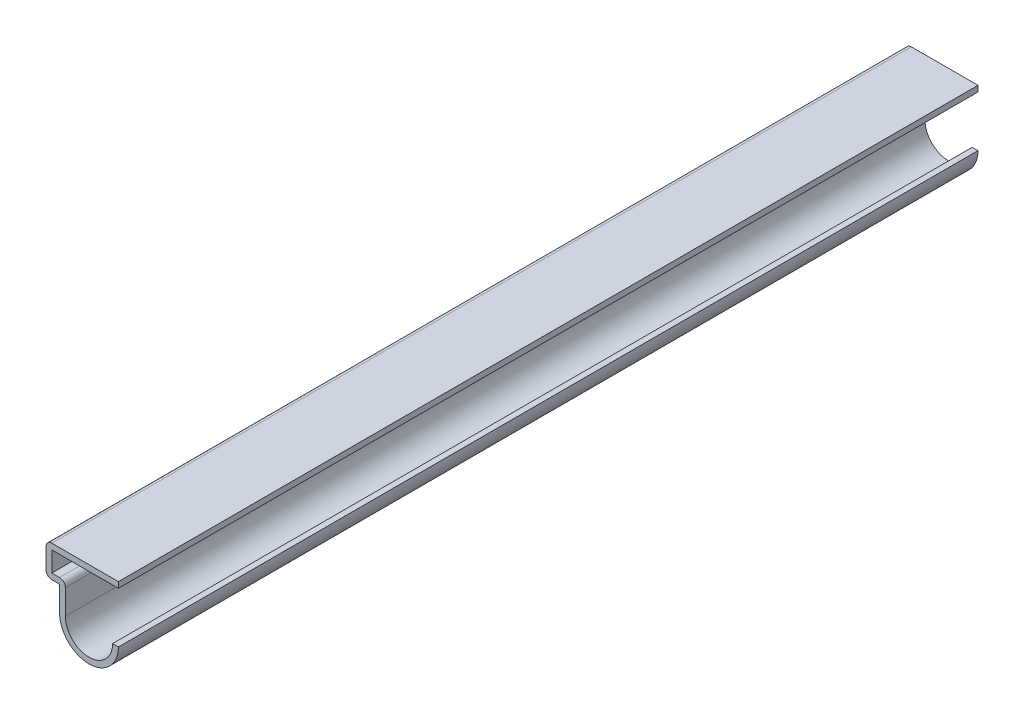
ISO-10303-21;
HEADER;
FILE_DESCRIPTION(('STEP AP214'),'2;1');
FILE_NAME('part.step','',(''),(''),'','','');
FILE_SCHEMA(('AUTOMOTIVE_DESIGN { 1 0 10303 214 1 1 1 1 }'));
ENDSEC;
DATA;
#1=APPLICATION_CONTEXT('core data for automotive mechanical design processes');
#2=APPLICATION_PROTOCOL_DEFINITION('international standard','automotive_design',2000,#1);
#3=PRODUCT_CONTEXT('',#1,'mechanical');
#4=PRODUCT('Part','Part','',(#3));
#5=PRODUCT_RELATED_PRODUCT_CATEGORY('part','',(#4));
#6=PRODUCT_DEFINITION_FORMATION('','',#4);
#7=PRODUCT_DEFINITION_CONTEXT('part definition',#1,'design');
#8=PRODUCT_DEFINITION('design','',#6,#7);
#9=PRODUCT_DEFINITION_SHAPE('','',#8);
#10=(LENGTH_UNIT() NAMED_UNIT(*) SI_UNIT(.MILLI.,.METRE.));
#11=(NAMED_UNIT(*) PLANE_ANGLE_UNIT() SI_UNIT($,.RADIAN.));
#12=(NAMED_UNIT(*) SI_UNIT($,.STERADIAN.) SOLID_ANGLE_UNIT());
#13=UNCERTAINTY_MEASURE_WITH_UNIT(LENGTH_MEASURE(1.E-05),#10,'distance_accuracy_value','');
#14=(GEOMETRIC_REPRESENTATION_CONTEXT(3) GLOBAL_UNCERTAINTY_ASSIGNED_CONTEXT((#13)) GLOBAL_UNIT_ASSIGNED_CONTEXT((#10,
#11,#12)) REPRESENTATION_CONTEXT('',''));
#15=CARTESIAN_POINT('',(0.,0.,0.));
#16=DIRECTION('',(0.,0.,1.));
#17=DIRECTION('',(1.,0.,0.));
#18=AXIS2_PLACEMENT_3D('',#15,#16,#17);
#19=CARTESIAN_POINT('',(-12.7,8.905875,-150.8125));
#20=DIRECTION('',(0.,-1.,0.));
#21=DIRECTION('',(0.,0.,-1.));
#22=AXIS2_PLACEMENT_3D('',#19,#20,#21);
#23=PLANE('',#22);
#24=DIRECTION('',(1.,0.,0.));
#25=VECTOR('',#24,1.);
#26=CARTESIAN_POINT('',(-12.7,8.905875,0.));
#27=LINE('',#26,#25);
#28=CARTESIAN_POINT('',(-11.684,8.905875,0.));
#29=VERTEX_POINT('',#28);
#30=CARTESIAN_POINT('',(0.,8.905875,0.));
#31=VERTEX_POINT('',#30);
#32=EDGE_CURVE('E195',#29,#31,#27,.T.);
#33=ORIENTED_EDGE('',*,*,#32,.F.);
#34=DIRECTION('',(0.,0.,1.));
#35=VECTOR('',#34,1.);
#36=CARTESIAN_POINT('',(-11.684,8.905875,-150.8125));
#37=LINE('',#36,#35);
#38=CARTESIAN_POINT('',(-11.684,8.905875,-150.8125));
#39=VERTEX_POINT('',#38);
#40=EDGE_CURVE('E167',#39,#29,#37,.T.);
#41=ORIENTED_EDGE('',*,*,#40,.F.);
#42=DIRECTION('',(1.,0.,0.));
#43=VECTOR('',#42,1.);
#44=CARTESIAN_POINT('',(-12.7,8.905875,-150.8125));
#45=LINE('',#44,#43);
#46=CARTESIAN_POINT('',(0.,8.905875,-150.8125));
#47=VERTEX_POINT('',#46);
#48=EDGE_CURVE('E149',#39,#47,#45,.T.);
#49=ORIENTED_EDGE('',*,*,#48,.T.);
#50=DIRECTION('',(0.,0.,1.));
#51=VECTOR('',#50,1.);
#52=CARTESIAN_POINT('',(0.,8.905875,-150.8125));
#53=LINE('',#52,#51);
#54=EDGE_CURVE('E157',#47,#31,#53,.T.);
#55=ORIENTED_EDGE('',*,*,#54,.T.);
#56=EDGE_LOOP('',(#33,#41,#49,#55));
#57=FACE_BOUND('',#56,.T.);
#58=ADVANCED_FACE('F35',(#57),#23,.T.);
#59=CARTESIAN_POINT('',(-11.684,4.365625,-150.8125));
#60=DIRECTION('',(1.,0.,0.));
#61=DIRECTION('',(0.,0.,-1.));
#62=AXIS2_PLACEMENT_3D('',#59,#60,#61);
#63=PLANE('',#62);
#64=DIRECTION('',(0.,1.,0.));
#65=VECTOR('',#64,1.);
#66=CARTESIAN_POINT('',(-11.684,4.365625,0.));
#67=LINE('',#66,#65);
#68=CARTESIAN_POINT('',(-11.684,5.381625,0.));
#69=VERTEX_POINT('',#68);
#70=EDGE_CURVE('E168',#69,#29,#67,.T.);
#71=ORIENTED_EDGE('',*,*,#70,.F.);
#72=DIRECTION('',(0.,0.,1.));
#73=VECTOR('',#72,1.);
#74=CARTESIAN_POINT('',(-11.684,5.381625,-150.8125));
#75=LINE('',#74,#73);
#76=CARTESIAN_POINT('',(-11.684,5.381625,-150.8125));
#77=VERTEX_POINT('',#76);
#78=EDGE_CURVE('E220',#77,#69,#75,.T.);
#79=ORIENTED_EDGE('',*,*,#78,.F.);
#80=DIRECTION('',(0.,1.,0.));
#81=VECTOR('',#80,1.);
#82=CARTESIAN_POINT('',(-11.684,4.365625,-150.8125));
#83=LINE('',#82,#81);
#84=EDGE_CURVE('E165',#77,#39,#83,.T.);
#85=ORIENTED_EDGE('',*,*,#84,.T.);
#86=ORIENTED_EDGE('',*,*,#40,.T.);
#87=EDGE_LOOP('',(#71,#79,#85,#86));
#88=FACE_BOUND('',#87,.T.);
#89=ADVANCED_FACE('F279',(#88),#63,.T.);
#90=CARTESIAN_POINT('',(-10.31875,5.381625,-150.8125));
#91=DIRECTION('',(0.,1.,0.));
#92=DIRECTION('',(-1.,0.,0.));
#93=AXIS2_PLACEMENT_3D('',#90,#91,#92);
#94=PLANE('',#93);
#95=DIRECTION('',(-1.,0.,0.));
#96=VECTOR('',#95,1.);
#97=CARTESIAN_POINT('',(-10.31875,5.381625,0.));
#98=LINE('',#97,#96);
#99=CARTESIAN_POINT('',(-10.31875,5.381625,0.));
#100=VERTEX_POINT('',#99);
#101=EDGE_CURVE('E171',#100,#69,#98,.T.);
#102=ORIENTED_EDGE('',*,*,#101,.F.);
#103=DIRECTION('',(0.,0.,1.));
#104=VECTOR('',#103,1.);
#105=CARTESIAN_POINT('',(-10.31875,5.381625,-150.8125));
#106=LINE('',#105,#104);
#107=CARTESIAN_POINT('',(-10.31875,5.381625,-150.8125));
#108=VERTEX_POINT('',#107);
#109=EDGE_CURVE('E245',#100,#108,#106,.F.);
#110=ORIENTED_EDGE('',*,*,#109,.T.);
#111=DIRECTION('',(-1.,0.,0.));
#112=VECTOR('',#111,1.);
#113=CARTESIAN_POINT('',(-10.31875,5.381625,-150.8125));
#114=LINE('',#113,#112);
#115=EDGE_CURVE('E192',#108,#77,#114,.T.);
#116=ORIENTED_EDGE('',*,*,#115,.T.);
#117=ORIENTED_EDGE('',*,*,#78,.T.);
#118=EDGE_LOOP('',(#102,#110,#116,#117));
#119=FACE_BOUND('',#118,.T.);
#120=ADVANCED_FACE('F320',(#119),#94,.T.);
#121=CARTESIAN_POINT('',(-9.30275,0.,-150.8125));
#122=DIRECTION('',(1.,0.,0.));
#123=DIRECTION('',(0.,0.,-1.));
#124=AXIS2_PLACEMENT_3D('',#121,#122,#123);
#125=PLANE('',#124);
#126=DIRECTION('',(0.,1.,0.));
#127=VECTOR('',#126,1.);
#128=CARTESIAN_POINT('',(-9.30275,0.,-150.8125));
#129=LINE('',#128,#127);
#130=CARTESIAN_POINT('',(-9.30275,0.,-150.8125));
#131=VERTEX_POINT('',#130);
#132=CARTESIAN_POINT('',(-9.30275,4.365625,-150.8125));
#133=VERTEX_POINT('',#132);
#134=EDGE_CURVE('E189',#131,#133,#129,.T.);
#135=ORIENTED_EDGE('',*,*,#134,.T.);
#136=DIRECTION('',(0.,0.,1.));
#137=VECTOR('',#136,1.);
#138=CARTESIAN_POINT('',(-9.30275,4.365625,-150.8125));
#139=LINE('',#138,#137);
#140=CARTESIAN_POINT('',(-9.30275,4.365625,0.));
#141=VERTEX_POINT('',#140);
#142=EDGE_CURVE('E219',#133,#141,#139,.T.);
#143=ORIENTED_EDGE('',*,*,#142,.T.);
#144=DIRECTION('',(0.,1.,0.));
#145=VECTOR('',#144,1.);
#146=CARTESIAN_POINT('',(-9.30275,0.,0.));
#147=LINE('',#146,#145);
#148=CARTESIAN_POINT('',(-9.30275,0.,0.));
#149=VERTEX_POINT('',#148);
#150=EDGE_CURVE('E214',#149,#141,#147,.T.);
#151=ORIENTED_EDGE('',*,*,#150,.F.);
#152=DIRECTION('',(0.,0.,1.));
#153=VECTOR('',#152,1.);
#154=CARTESIAN_POINT('',(-9.30275,0.,-150.8125));
#155=LINE('',#154,#153);
#156=EDGE_CURVE('E223',#131,#149,#155,.T.);
#157=ORIENTED_EDGE('',*,*,#156,.F.);
#158=EDGE_LOOP('',(#135,#143,#151,#157));
#159=FACE_BOUND('',#158,.T.);
#160=ADVANCED_FACE('F289',(#159),#125,.T.);
#161=CARTESIAN_POINT('',(-5.159375,0.,-150.8125));
#162=DIRECTION('',(0.,0.,1.));
#163=DIRECTION('',(1.,0.,0.));
#164=AXIS2_PLACEMENT_3D('',#161,#162,#163);
#165=CYLINDRICAL_SURFACE('',#164,4.143375);
#166=CARTESIAN_POINT('',(-5.159375,0.,0.));
#167=DIRECTION('',(0.,0.,1.));
#168=DIRECTION('',(1.,0.,0.));
#169=AXIS2_PLACEMENT_3D('',#166,#167,#168);
#170=CIRCLE('',#169,4.143375);
#171=CARTESIAN_POINT('',(-1.016,0.,0.));
#172=VERTEX_POINT('',#171);
#173=EDGE_CURVE('E211',#172,#149,#170,.F.);
#174=ORIENTED_EDGE('',*,*,#173,.F.);
#175=DIRECTION('',(0.,0.,1.));
#176=VECTOR('',#175,1.);
#177=CARTESIAN_POINT('',(-1.016,0.,-150.8125));
#178=LINE('',#177,#176);
#179=CARTESIAN_POINT('',(-1.016,0.,-150.8125));
#180=VERTEX_POINT('',#179);
#181=EDGE_CURVE('E225',#180,#172,#178,.T.);
#182=ORIENTED_EDGE('',*,*,#181,.F.);
#183=CARTESIAN_POINT('',(-5.159375,0.,-150.8125));
#184=DIRECTION('',(0.,0.,1.));
#185=DIRECTION('',(1.,0.,0.));
#186=AXIS2_PLACEMENT_3D('',#183,#184,#185);
#187=CIRCLE('',#186,4.143375);
#188=EDGE_CURVE('E186',#180,#131,#187,.F.);
#189=ORIENTED_EDGE('',*,*,#188,.T.);
#190=ORIENTED_EDGE('',*,*,#156,.T.);
#191=EDGE_LOOP('',(#174,#182,#189,#190));
#192=FACE_BOUND('',#191,.T.);
#193=ADVANCED_FACE('F294',(#192),#165,.F.);
#194=CARTESIAN_POINT('',(-1.016,0.,-150.8125));
#195=DIRECTION('',(0.,-1.,0.));
#196=DIRECTION('',(1.,0.,0.));
#197=AXIS2_PLACEMENT_3D('',#194,#195,#196);
#198=PLANE('',#197);
#199=DIRECTION('',(1.,0.,0.));
#200=VECTOR('',#199,1.);
#201=CARTESIAN_POINT('',(-1.016,0.,0.));
#202=LINE('',#201,#200);
#203=CARTESIAN_POINT('',(0.,0.,0.));
#204=VERTEX_POINT('',#203);
#205=EDGE_CURVE('E209',#172,#204,#202,.T.);
#206=ORIENTED_EDGE('',*,*,#205,.T.);
#207=DIRECTION('',(0.,0.,1.));
#208=VECTOR('',#207,1.);
#209=CARTESIAN_POINT('',(0.,0.,-150.8125));
#210=LINE('',#209,#208);
#211=CARTESIAN_POINT('',(0.,0.,-150.8125));
#212=VERTEX_POINT('',#211);
#213=EDGE_CURVE('E227',#212,#204,#210,.T.);
#214=ORIENTED_EDGE('',*,*,#213,.F.);
#215=DIRECTION('',(1.,0.,0.));
#216=VECTOR('',#215,1.);
#217=CARTESIAN_POINT('',(-1.016,0.,-150.8125));
#218=LINE('',#217,#216);
#219=EDGE_CURVE('E184',#180,#212,#218,.T.);
#220=ORIENTED_EDGE('',*,*,#219,.F.);
#221=ORIENTED_EDGE('',*,*,#181,.T.);
#222=EDGE_LOOP('',(#206,#214,#220,#221));
#223=FACE_BOUND('',#222,.T.);
#224=ADVANCED_FACE('F301',(#223),#198,.F.);
#225=CARTESIAN_POINT('',(-5.159375,0.,-150.8125));
#226=DIRECTION('',(0.,0.,1.));
#227=DIRECTION('',(1.,0.,0.));
#228=AXIS2_PLACEMENT_3D('',#225,#226,#227);
#229=CYLINDRICAL_SURFACE('',#228,5.159375);
#230=CARTESIAN_POINT('',(-5.159375,0.,0.));
#231=DIRECTION('',(0.,0.,-1.));
#232=DIRECTION('',(-1.,0.,0.));
#233=AXIS2_PLACEMENT_3D('',#230,#231,#232);
#234=CIRCLE('',#233,5.159375);
#235=CARTESIAN_POINT('',(-10.31875,0.,0.));
#236=VERTEX_POINT('',#235);
#237=EDGE_CURVE('E207',#204,#236,#234,.T.);
#238=ORIENTED_EDGE('',*,*,#237,.T.);
#239=DIRECTION('',(0.,0.,1.));
#240=VECTOR('',#239,1.);
#241=CARTESIAN_POINT('',(-10.31875,0.,-150.8125));
#242=LINE('',#241,#240);
#243=CARTESIAN_POINT('',(-10.31875,0.,-150.8125));
#244=VERTEX_POINT('',#243);
#245=EDGE_CURVE('E230',#244,#236,#242,.T.);
#246=ORIENTED_EDGE('',*,*,#245,.F.);
#247=CARTESIAN_POINT('',(-5.159375,0.,-150.8125));
#248=DIRECTION('',(0.,0.,-1.));
#249=DIRECTION('',(-1.,0.,0.));
#250=AXIS2_PLACEMENT_3D('',#247,#248,#249);
#251=CIRCLE('',#250,5.159375);
#252=EDGE_CURVE('E182',#212,#244,#251,.T.);
#253=ORIENTED_EDGE('',*,*,#252,.F.);
#254=ORIENTED_EDGE('',*,*,#213,.T.);
#255=EDGE_LOOP('',(#238,#246,#253,#254));
#256=FACE_BOUND('',#255,.T.);
#257=ADVANCED_FACE('F303',(#256),#229,.T.);
#258=CARTESIAN_POINT('',(-10.31875,0.,-150.8125));
#259=DIRECTION('',(1.,0.,0.));
#260=DIRECTION('',(0.,0.,-1.));
#261=AXIS2_PLACEMENT_3D('',#258,#259,#260);
#262=PLANE('',#261);
#263=DIRECTION('',(0.,1.,0.));
#264=VECTOR('',#263,1.);
#265=CARTESIAN_POINT('',(-10.31875,0.,0.));
#266=LINE('',#265,#264);
#267=CARTESIAN_POINT('',(-10.31875,4.365625,0.));
#268=VERTEX_POINT('',#267);
#269=EDGE_CURVE('E205',#236,#268,#266,.T.);
#270=ORIENTED_EDGE('',*,*,#269,.T.);
#271=DIRECTION('',(0.,0.,1.));
#272=VECTOR('',#271,1.);
#273=CARTESIAN_POINT('',(-10.31875,4.365625,-150.8125));
#274=LINE('',#273,#272);
#275=CARTESIAN_POINT('',(-10.31875,4.365625,-150.8125));
#276=VERTEX_POINT('',#275);
#277=EDGE_CURVE('E233',#276,#268,#274,.T.);
#278=ORIENTED_EDGE('',*,*,#277,.F.);
#279=DIRECTION('',(0.,1.,0.));
#280=VECTOR('',#279,1.);
#281=CARTESIAN_POINT('',(-10.31875,0.,-150.8125));
#282=LINE('',#281,#280);
#283=EDGE_CURVE('E180',#244,#276,#282,.T.);
#284=ORIENTED_EDGE('',*,*,#283,.F.);
#285=ORIENTED_EDGE('',*,*,#245,.T.);
#286=EDGE_LOOP('',(#270,#278,#284,#285));
#287=FACE_BOUND('',#286,.T.);
#288=ADVANCED_FACE('F306',(#287),#262,.F.);
#289=CARTESIAN_POINT('',(-10.31875,4.365625,-150.8125));
#290=DIRECTION('',(0.,1.,0.));
#291=DIRECTION('',(-1.,0.,0.));
#292=AXIS2_PLACEMENT_3D('',#289,#290,#291);
#293=PLANE('',#292);
#294=DIRECTION('',(-1.,0.,0.));
#295=VECTOR('',#294,1.);
#296=CARTESIAN_POINT('',(-10.31875,4.365625,0.));
#297=LINE('',#296,#295);
#298=CARTESIAN_POINT('',(-11.684,4.365625,0.));
#299=VERTEX_POINT('',#298);
#300=EDGE_CURVE('E202',#268,#299,#297,.T.);
#301=ORIENTED_EDGE('',*,*,#300,.T.);
#302=DIRECTION('',(0.,0.,1.));
#303=VECTOR('',#302,1.);
#304=CARTESIAN_POINT('',(-11.684,4.365625,-150.8125));
#305=LINE('',#304,#303);
#306=CARTESIAN_POINT('',(-11.684,4.365625,-150.8125));
#307=VERTEX_POINT('',#306);
#308=EDGE_CURVE('E43',#299,#307,#305,.F.);
#309=ORIENTED_EDGE('',*,*,#308,.T.);
#310=DIRECTION('',(-1.,0.,0.));
#311=VECTOR('',#310,1.);
#312=CARTESIAN_POINT('',(-10.31875,4.365625,-150.8125));
#313=LINE('',#312,#311);
#314=EDGE_CURVE('E177',#276,#307,#313,.T.);
#315=ORIENTED_EDGE('',*,*,#314,.F.);
#316=ORIENTED_EDGE('',*,*,#277,.T.);
#317=EDGE_LOOP('',(#301,#309,#315,#316));
#318=FACE_BOUND('',#317,.T.);
#319=ADVANCED_FACE('F258',(#318),#293,.F.);
#320=CARTESIAN_POINT('',(-12.7,4.365625,-150.8125));
#321=DIRECTION('',(1.,0.,0.));
#322=DIRECTION('',(0.,0.,-1.));
#323=AXIS2_PLACEMENT_3D('',#320,#321,#322);
#324=PLANE('',#323);
#325=DIRECTION('',(0.,1.,0.));
#326=VECTOR('',#325,1.);
#327=CARTESIAN_POINT('',(-12.7,4.365625,-150.8125));
#328=LINE('',#327,#326);
#329=CARTESIAN_POINT('',(-12.7,5.381625,-150.8125));
#330=VERTEX_POINT('',#329);
#331=CARTESIAN_POINT('',(-12.7,8.905875,-150.8125));
#332=VERTEX_POINT('',#331);
#333=EDGE_CURVE('E175',#330,#332,#328,.T.);
#334=ORIENTED_EDGE('',*,*,#333,.F.);
#335=DIRECTION('',(0.,0.,1.));
#336=VECTOR('',#335,1.);
#337=CARTESIAN_POINT('',(-12.7,5.381625,-150.8125));
#338=LINE('',#337,#336);
#339=CARTESIAN_POINT('',(-12.7,5.381625,0.));
#340=VERTEX_POINT('',#339);
#341=EDGE_CURVE('E253',#330,#340,#338,.T.);
#342=ORIENTED_EDGE('',*,*,#341,.T.);
#343=DIRECTION('',(0.,1.,0.));
#344=VECTOR('',#343,1.);
#345=CARTESIAN_POINT('',(-12.7,4.365625,0.));
#346=LINE('',#345,#344);
#347=CARTESIAN_POINT('',(-12.7,8.905875,0.));
#348=VERTEX_POINT('',#347);
#349=EDGE_CURVE('E200',#340,#348,#346,.T.);
#350=ORIENTED_EDGE('',*,*,#349,.T.);
#351=DIRECTION('',(0.,0.,1.));
#352=VECTOR('',#351,1.);
#353=CARTESIAN_POINT('',(-12.7,8.905875,-150.8125));
#354=LINE('',#353,#352);
#355=EDGE_CURVE('E58',#348,#332,#354,.F.);
#356=ORIENTED_EDGE('',*,*,#355,.T.);
#357=EDGE_LOOP('',(#334,#342,#350,#356));
#358=FACE_BOUND('',#357,.T.);
#359=ADVANCED_FACE('F267',(#358),#324,.F.);
#360=CARTESIAN_POINT('',(-12.7,9.921875,-150.8125));
#361=DIRECTION('',(0.,-1.,0.));
#362=DIRECTION('',(0.,0.,-1.));
#363=AXIS2_PLACEMENT_3D('',#360,#361,#362);
#364=PLANE('',#363);
#365=DIRECTION('',(1.,0.,0.));
#366=VECTOR('',#365,1.);
#367=CARTESIAN_POINT('',(-12.7,9.921875,-150.8125));
#368=LINE('',#367,#366);
#369=CARTESIAN_POINT('',(-11.684,9.921875,-150.8125));
#370=VERTEX_POINT('',#369);
#371=CARTESIAN_POINT('',(0.,9.921875,-150.8125));
#372=VERTEX_POINT('',#371);
#373=EDGE_CURVE('E151',#370,#372,#368,.T.);
#374=ORIENTED_EDGE('',*,*,#373,.F.);
#375=DIRECTION('',(0.,0.,1.));
#376=VECTOR('',#375,1.);
#377=CARTESIAN_POINT('',(-11.684,9.921875,-150.8125));
#378=LINE('',#377,#376);
#379=CARTESIAN_POINT('',(-11.684,9.921875,0.));
#380=VERTEX_POINT('',#379);
#381=EDGE_CURVE('E11',#370,#380,#378,.T.);
#382=ORIENTED_EDGE('',*,*,#381,.T.);
#383=DIRECTION('',(1.,0.,0.));
#384=VECTOR('',#383,1.);
#385=CARTESIAN_POINT('',(-12.7,9.921875,0.));
#386=LINE('',#385,#384);
#387=CARTESIAN_POINT('',(0.,9.921875,0.));
#388=VERTEX_POINT('',#387);
#389=EDGE_CURVE('E198',#380,#388,#386,.T.);
#390=ORIENTED_EDGE('',*,*,#389,.T.);
#391=DIRECTION('',(0.,0.,1.));
#392=VECTOR('',#391,1.);
#393=CARTESIAN_POINT('',(0.,9.921875,-150.8125));
#394=LINE('',#393,#392);
#395=EDGE_CURVE('E164',#372,#388,#394,.T.);
#396=ORIENTED_EDGE('',*,*,#395,.F.);
#397=EDGE_LOOP('',(#374,#382,#390,#396));
#398=FACE_BOUND('',#397,.T.);
#399=ADVANCED_FACE('F274',(#398),#364,.F.);
#400=CARTESIAN_POINT('',(0.,9.921875,-150.8125));
#401=DIRECTION('',(-1.,0.,0.));
#402=DIRECTION('',(0.,0.,1.));
#403=AXIS2_PLACEMENT_3D('',#400,#401,#402);
#404=PLANE('',#403);
#405=DIRECTION('',(0.,-1.,0.));
#406=VECTOR('',#405,1.);
#407=CARTESIAN_POINT('',(0.,9.921875,0.));
#408=LINE('',#407,#406);
#409=EDGE_CURVE('E160',#388,#31,#408,.T.);
#410=ORIENTED_EDGE('',*,*,#409,.T.);
#411=ORIENTED_EDGE('',*,*,#54,.F.);
#412=DIRECTION('',(0.,-1.,0.));
#413=VECTOR('',#412,1.);
#414=CARTESIAN_POINT('',(0.,9.921875,-150.8125));
#415=LINE('',#414,#413);
#416=EDGE_CURVE('E143',#372,#47,#415,.T.);
#417=ORIENTED_EDGE('',*,*,#416,.F.);
#418=ORIENTED_EDGE('',*,*,#395,.T.);
#419=EDGE_LOOP('',(#410,#411,#417,#418));
#420=FACE_BOUND('',#419,.T.);
#421=ADVANCED_FACE('F158',(#420),#404,.F.);
#422=CARTESIAN_POINT('',(-5.159375,0.,-150.8125));
#423=DIRECTION('',(0.,0.,-1.));
#424=DIRECTION('',(-1.,0.,0.));
#425=AXIS2_PLACEMENT_3D('',#422,#423,#424);
#426=PLANE('',#425);
#427=ORIENTED_EDGE('',*,*,#115,.F.);
#428=CARTESIAN_POINT('',(-10.31875,4.365625,-150.8125));
#429=DIRECTION('',(0.,0.,-1.));
#430=DIRECTION('',(-1.,0.,0.));
#431=AXIS2_PLACEMENT_3D('',#428,#429,#430);
#432=CIRCLE('',#431,1.016);
#433=EDGE_CURVE('E250',#108,#133,#432,.T.);
#434=ORIENTED_EDGE('',*,*,#433,.T.);
#435=ORIENTED_EDGE('',*,*,#134,.F.);
#436=ORIENTED_EDGE('',*,*,#188,.F.);
#437=ORIENTED_EDGE('',*,*,#219,.T.);
#438=ORIENTED_EDGE('',*,*,#252,.T.);
#439=ORIENTED_EDGE('',*,*,#283,.T.);
#440=ORIENTED_EDGE('',*,*,#314,.T.);
#441=CARTESIAN_POINT('',(-11.684,5.381625,-150.8125));
#442=DIRECTION('',(0.,0.,-1.));
#443=DIRECTION('',(-1.,0.,0.));
#444=AXIS2_PLACEMENT_3D('',#441,#442,#443);
#445=CIRCLE('',#444,1.016);
#446=EDGE_CURVE('E248',#307,#330,#445,.T.);
#447=ORIENTED_EDGE('',*,*,#446,.T.);
#448=ORIENTED_EDGE('',*,*,#333,.T.);
#449=CARTESIAN_POINT('',(-11.684,8.905875,-150.8125));
#450=DIRECTION('',(0.,0.,-1.));
#451=DIRECTION('',(-1.,0.,0.));
#452=AXIS2_PLACEMENT_3D('',#449,#450,#451);
#453=CIRCLE('',#452,1.016);
#454=EDGE_CURVE('E50',#332,#370,#453,.T.);
#455=ORIENTED_EDGE('',*,*,#454,.T.);
#456=ORIENTED_EDGE('',*,*,#373,.T.);
#457=ORIENTED_EDGE('',*,*,#416,.T.);
#458=ORIENTED_EDGE('',*,*,#48,.F.);
#459=ORIENTED_EDGE('',*,*,#84,.F.);
#460=EDGE_LOOP('',(#427,#434,#435,#436,#437,#438,#439,#440,#447,#448,#455,#456,#457,#458,#459));
#461=FACE_BOUND('',#460,.T.);
#462=ADVANCED_FACE('F146',(#461),#426,.T.);
#463=CARTESIAN_POINT('',(-5.159375,0.,0.));
#464=DIRECTION('',(0.,0.,-1.));
#465=DIRECTION('',(-1.,0.,0.));
#466=AXIS2_PLACEMENT_3D('',#463,#464,#465);
#467=PLANE('',#466);
#468=ORIENTED_EDGE('',*,*,#150,.T.);
#469=CARTESIAN_POINT('',(-10.31875,4.365625,0.));
#470=DIRECTION('',(0.,0.,-1.));
#471=DIRECTION('',(-1.,0.,0.));
#472=AXIS2_PLACEMENT_3D('',#469,#470,#471);
#473=CIRCLE('',#472,1.016);
#474=EDGE_CURVE('E243',#141,#100,#473,.F.);
#475=ORIENTED_EDGE('',*,*,#474,.T.);
#476=ORIENTED_EDGE('',*,*,#101,.T.);
#477=ORIENTED_EDGE('',*,*,#70,.T.);
#478=ORIENTED_EDGE('',*,*,#32,.T.);
#479=ORIENTED_EDGE('',*,*,#409,.F.);
#480=ORIENTED_EDGE('',*,*,#389,.F.);
#481=CARTESIAN_POINT('',(-11.684,8.905875,0.));
#482=DIRECTION('',(0.,0.,-1.));
#483=DIRECTION('',(-1.,0.,0.));
#484=AXIS2_PLACEMENT_3D('',#481,#482,#483);
#485=CIRCLE('',#484,1.016);
#486=EDGE_CURVE('E239',#380,#348,#485,.F.);
#487=ORIENTED_EDGE('',*,*,#486,.T.);
#488=ORIENTED_EDGE('',*,*,#349,.F.);
#489=CARTESIAN_POINT('',(-11.684,5.381625,0.));
#490=DIRECTION('',(0.,0.,-1.));
#491=DIRECTION('',(-1.,0.,0.));
#492=AXIS2_PLACEMENT_3D('',#489,#490,#491);
#493=CIRCLE('',#492,1.016);
#494=EDGE_CURVE('E241',#340,#299,#493,.F.);
#495=ORIENTED_EDGE('',*,*,#494,.T.);
#496=ORIENTED_EDGE('',*,*,#300,.F.);
#497=ORIENTED_EDGE('',*,*,#269,.F.);
#498=ORIENTED_EDGE('',*,*,#237,.F.);
#499=ORIENTED_EDGE('',*,*,#205,.F.);
#500=ORIENTED_EDGE('',*,*,#173,.T.);
#501=EDGE_LOOP('',(#468,#475,#476,#477,#478,#479,#480,#487,#488,#495,#496,#497,#498,#499,#500));
#502=FACE_BOUND('',#501,.T.);
#503=ADVANCED_FACE('F269',(#502),#467,.F.);
#504=CARTESIAN_POINT('',(-10.31875,4.365625,-150.8125));
#505=DIRECTION('',(0.,0.,1.));
#506=DIRECTION('',(1.,0.,0.));
#507=AXIS2_PLACEMENT_3D('',#504,#505,#506);
#508=CYLINDRICAL_SURFACE('',#507,1.016);
#509=ORIENTED_EDGE('',*,*,#433,.F.);
#510=ORIENTED_EDGE('',*,*,#109,.F.);
#511=ORIENTED_EDGE('',*,*,#474,.F.);
#512=ORIENTED_EDGE('',*,*,#142,.F.);
#513=EDGE_LOOP('',(#509,#510,#511,#512));
#514=FACE_BOUND('',#513,.T.);
#515=ADVANCED_FACE('F286',(#514),#508,.T.);
#516=CARTESIAN_POINT('',(-11.684,5.381625,-150.8125));
#517=DIRECTION('',(0.,0.,1.));
#518=DIRECTION('',(1.,0.,0.));
#519=AXIS2_PLACEMENT_3D('',#516,#517,#518);
#520=CYLINDRICAL_SURFACE('',#519,1.016);
#521=ORIENTED_EDGE('',*,*,#446,.F.);
#522=ORIENTED_EDGE('',*,*,#308,.F.);
#523=ORIENTED_EDGE('',*,*,#494,.F.);
#524=ORIENTED_EDGE('',*,*,#341,.F.);
#525=EDGE_LOOP('',(#521,#522,#523,#524));
#526=FACE_BOUND('',#525,.T.);
#527=ADVANCED_FACE('F265',(#526),#520,.T.);
#528=CARTESIAN_POINT('',(-11.684,8.905875,-150.8125));
#529=DIRECTION('',(0.,0.,1.));
#530=DIRECTION('',(1.,0.,0.));
#531=AXIS2_PLACEMENT_3D('',#528,#529,#530);
#532=CYLINDRICAL_SURFACE('',#531,1.016);
#533=ORIENTED_EDGE('',*,*,#454,.F.);
#534=ORIENTED_EDGE('',*,*,#355,.F.);
#535=ORIENTED_EDGE('',*,*,#486,.F.);
#536=ORIENTED_EDGE('',*,*,#381,.F.);
#537=EDGE_LOOP('',(#533,#534,#535,#536));
#538=FACE_BOUND('',#537,.T.);
#539=ADVANCED_FACE('F37',(#538),#532,.T.);
#540=CLOSED_SHELL('',(#58,#89,#120,#160,#193,#224,#257,#288,#319,#359,#399,#421,#462,#503,#515,
#527,#539));
#541=MANIFOLD_SOLID_BREP('B2',#540);
#542=ADVANCED_BREP_SHAPE_REPRESENTATION('',(#18,#541),#14);
#543=SHAPE_DEFINITION_REPRESENTATION(#9,#542);
ENDSEC;
END-ISO-10303-21;
